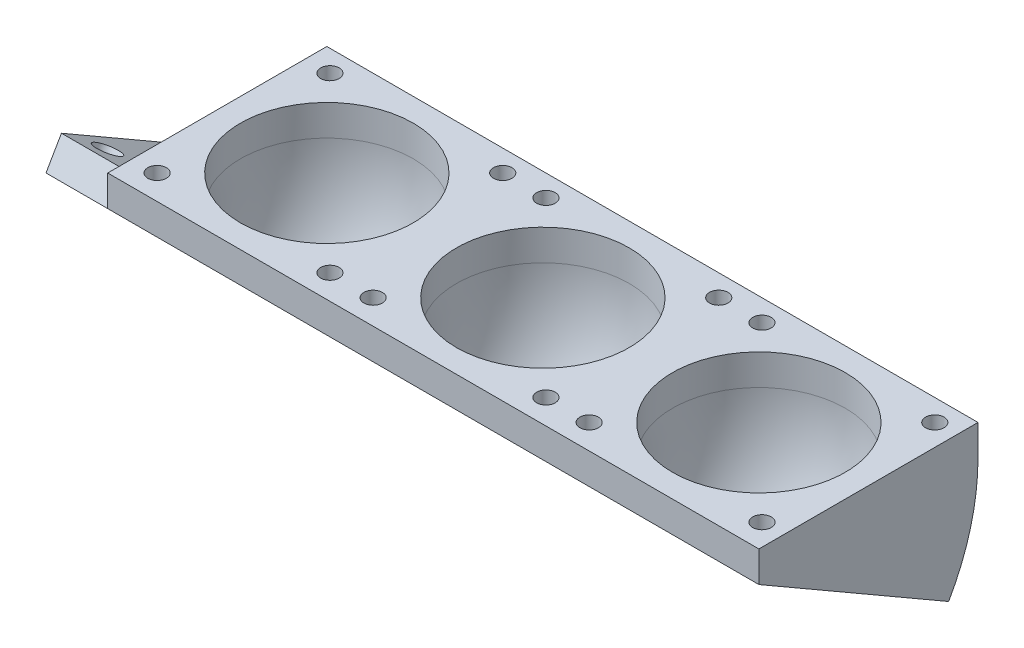
ISO-10303-21;
HEADER;
FILE_DESCRIPTION(('STEP AP214'),'2;1');
FILE_NAME('part.step','',(''),(''),'','','');
FILE_SCHEMA(('AUTOMOTIVE_DESIGN { 1 0 10303 214 1 1 1 1 }'));
ENDSEC;
DATA;
#1=APPLICATION_CONTEXT('core data for automotive mechanical design processes');
#2=APPLICATION_PROTOCOL_DEFINITION('international standard','automotive_design',2000,#1);
#3=PRODUCT_CONTEXT('',#1,'mechanical');
#4=PRODUCT('Part','Part','',(#3));
#5=PRODUCT_RELATED_PRODUCT_CATEGORY('part','',(#4));
#6=PRODUCT_DEFINITION_FORMATION('','',#4);
#7=PRODUCT_DEFINITION_CONTEXT('part definition',#1,'design');
#8=PRODUCT_DEFINITION('design','',#6,#7);
#9=PRODUCT_DEFINITION_SHAPE('','',#8);
#10=(LENGTH_UNIT() NAMED_UNIT(*) SI_UNIT(.MILLI.,.METRE.));
#11=(NAMED_UNIT(*) PLANE_ANGLE_UNIT() SI_UNIT($,.RADIAN.));
#12=(NAMED_UNIT(*) SI_UNIT($,.STERADIAN.) SOLID_ANGLE_UNIT());
#13=UNCERTAINTY_MEASURE_WITH_UNIT(LENGTH_MEASURE(1.E-05),#10,'distance_accuracy_value','');
#14=(GEOMETRIC_REPRESENTATION_CONTEXT(3) GLOBAL_UNCERTAINTY_ASSIGNED_CONTEXT((#13)) GLOBAL_UNIT_ASSIGNED_CONTEXT((#10,
#11,#12)) REPRESENTATION_CONTEXT('',''));
#15=CARTESIAN_POINT('',(0.,0.,0.));
#16=DIRECTION('',(0.,0.,1.));
#17=DIRECTION('',(1.,0.,0.));
#18=AXIS2_PLACEMENT_3D('',#15,#16,#17);
#19=CARTESIAN_POINT('',(0.,10.,0.));
#20=DIRECTION('',(0.,1.,0.));
#21=DIRECTION('',(0.,0.,1.));
#22=AXIS2_PLACEMENT_3D('',#19,#20,#21);
#23=PLANE('',#22);
#24=DIRECTION('',(-1.,0.,0.));
#25=VECTOR('',#24,1.);
#26=CARTESIAN_POINT('',(-51.4922279792746,10.,-44.0544041450777));
#27=LINE('',#26,#25);
#28=CARTESIAN_POINT('',(159.507772020725,10.,-44.0544041450777));
#29=VERTEX_POINT('',#28);
#30=CARTESIAN_POINT('',(-51.4922279792746,10.,-44.0544041450777));
#31=VERTEX_POINT('',#30);
#32=EDGE_CURVE('E51',#29,#31,#27,.T.);
#33=ORIENTED_EDGE('',*,*,#32,.T.);
#34=DIRECTION('',(0.,0.,1.));
#35=VECTOR('',#34,1.);
#36=CARTESIAN_POINT('',(-51.4922279792746,10.,-44.0544041450777));
#37=LINE('',#36,#35);
#38=CARTESIAN_POINT('',(-51.4922279792746,10.,26.9455958549222));
#39=VERTEX_POINT('',#38);
#40=EDGE_CURVE('E171',#31,#39,#37,.T.);
#41=ORIENTED_EDGE('',*,*,#40,.T.);
#42=DIRECTION('',(1.,0.,0.));
#43=VECTOR('',#42,1.);
#44=CARTESIAN_POINT('',(-51.4922279792746,10.,26.9455958549222));
#45=LINE('',#44,#43);
#46=CARTESIAN_POINT('',(159.507772020725,10.,26.9455958549222));
#47=VERTEX_POINT('',#46);
#48=EDGE_CURVE('E173',#39,#47,#45,.T.);
#49=ORIENTED_EDGE('',*,*,#48,.T.);
#50=DIRECTION('',(0.,0.,-1.));
#51=VECTOR('',#50,1.);
#52=CARTESIAN_POINT('',(159.507772020725,10.,-44.0544041450777));
#53=LINE('',#52,#51);
#54=EDGE_CURVE('E185',#47,#29,#53,.T.);
#55=ORIENTED_EDGE('',*,*,#54,.T.);
#56=EDGE_LOOP('',(#33,#41,#49,#55));
#57=FACE_BOUND('',#56,.T.);
#58=CARTESIAN_POINT('',(54.0077720207254,10.,-8.55440414507775));
#59=DIRECTION('',(0.,1.,0.));
#60=DIRECTION('',(0.,0.,1.));
#61=AXIS2_PLACEMENT_3D('',#58,#59,#60);
#62=CIRCLE('',#61,28.);
#63=CARTESIAN_POINT('',(54.0077720207254,10.,19.4455958549222));
#64=VERTEX_POINT('',#63);
#65=EDGE_CURVE('E205',#64,#64,#62,.T.);
#66=ORIENTED_EDGE('',*,*,#65,.F.);
#67=EDGE_LOOP('',(#66));
#68=FACE_BOUND('',#67,.T.);
#69=CARTESIAN_POINT('',(82.5077720207254,10.,18.9455958549223));
#70=DIRECTION('',(0.,1.,0.));
#71=DIRECTION('',(0.,0.,1.));
#72=AXIS2_PLACEMENT_3D('',#69,#70,#71);
#73=CIRCLE('',#72,3.);
#74=CARTESIAN_POINT('',(82.5077720207254,10.,21.9455958549223));
#75=VERTEX_POINT('',#74);
#76=EDGE_CURVE('E217',#75,#75,#73,.T.);
#77=ORIENTED_EDGE('',*,*,#76,.F.);
#78=EDGE_LOOP('',(#77));
#79=FACE_BOUND('',#78,.T.);
#80=CARTESIAN_POINT('',(26.5077720207254,10.,-37.0544041450777));
#81=DIRECTION('',(0.,1.,0.));
#82=DIRECTION('',(0.,0.,1.));
#83=AXIS2_PLACEMENT_3D('',#80,#81,#82);
#84=CIRCLE('',#83,3.);
#85=CARTESIAN_POINT('',(26.5077720207254,10.,-34.0544041450777));
#86=VERTEX_POINT('',#85);
#87=EDGE_CURVE('E229',#86,#86,#84,.T.);
#88=ORIENTED_EDGE('',*,*,#87,.F.);
#89=EDGE_LOOP('',(#88));
#90=FACE_BOUND('',#89,.T.);
#91=CARTESIAN_POINT('',(82.5077720207254,10.,-37.0544041450777));
#92=DIRECTION('',(0.,1.,0.));
#93=DIRECTION('',(0.,0.,1.));
#94=AXIS2_PLACEMENT_3D('',#91,#92,#93);
#95=CIRCLE('',#94,3.);
#96=CARTESIAN_POINT('',(82.5077720207254,10.,-34.0544041450777));
#97=VERTEX_POINT('',#96);
#98=EDGE_CURVE('E223',#97,#97,#95,.T.);
#99=ORIENTED_EDGE('',*,*,#98,.F.);
#100=EDGE_LOOP('',(#99));
#101=FACE_BOUND('',#100,.T.);
#102=CARTESIAN_POINT('',(26.5077720207254,10.,18.9455958549223));
#103=DIRECTION('',(0.,1.,0.));
#104=DIRECTION('',(0.,0.,1.));
#105=AXIS2_PLACEMENT_3D('',#102,#103,#104);
#106=CIRCLE('',#105,3.);
#107=CARTESIAN_POINT('',(26.5077720207254,10.,21.9455958549223));
#108=VERTEX_POINT('',#107);
#109=EDGE_CURVE('E211',#108,#108,#106,.T.);
#110=ORIENTED_EDGE('',*,*,#109,.F.);
#111=EDGE_LOOP('',(#110));
#112=FACE_BOUND('',#111,.T.);
#113=CARTESIAN_POINT('',(96.5077720207254,10.,18.9455958549223));
#114=DIRECTION('',(0.,1.,0.));
#115=DIRECTION('',(0.,0.,1.));
#116=AXIS2_PLACEMENT_3D('',#113,#114,#115);
#117=CIRCLE('',#116,3.);
#118=CARTESIAN_POINT('',(96.5077720207254,10.,21.9455958549223));
#119=VERTEX_POINT('',#118);
#120=EDGE_CURVE('E263',#119,#119,#117,.T.);
#121=ORIENTED_EDGE('',*,*,#120,.F.);
#122=EDGE_LOOP('',(#121));
#123=FACE_BOUND('',#122,.T.);
#124=CARTESIAN_POINT('',(152.507772020725,10.,-37.0544041450777));
#125=DIRECTION('',(0.,1.,0.));
#126=DIRECTION('',(0.,0.,1.));
#127=AXIS2_PLACEMENT_3D('',#124,#125,#126);
#128=CIRCLE('',#127,3.);
#129=CARTESIAN_POINT('',(152.507772020725,10.,-34.0544041450777));
#130=VERTEX_POINT('',#129);
#131=EDGE_CURVE('E275',#130,#130,#128,.T.);
#132=ORIENTED_EDGE('',*,*,#131,.F.);
#133=EDGE_LOOP('',(#132));
#134=FACE_BOUND('',#133,.T.);
#135=CARTESIAN_POINT('',(96.5077720207254,10.,-37.0544041450777));
#136=DIRECTION('',(0.,1.,0.));
#137=DIRECTION('',(0.,0.,1.));
#138=AXIS2_PLACEMENT_3D('',#135,#136,#137);
#139=CIRCLE('',#138,3.);
#140=CARTESIAN_POINT('',(96.5077720207254,10.,-34.0544041450777));
#141=VERTEX_POINT('',#140);
#142=EDGE_CURVE('E197',#141,#141,#139,.T.);
#143=ORIENTED_EDGE('',*,*,#142,.F.);
#144=EDGE_LOOP('',(#143));
#145=FACE_BOUND('',#144,.T.);
#146=CARTESIAN_POINT('',(152.507772020725,10.,18.9455958549223));
#147=DIRECTION('',(0.,1.,0.));
#148=DIRECTION('',(0.,0.,1.));
#149=AXIS2_PLACEMENT_3D('',#146,#147,#148);
#150=CIRCLE('',#149,3.);
#151=CARTESIAN_POINT('',(152.507772020725,10.,21.9455958549223));
#152=VERTEX_POINT('',#151);
#153=EDGE_CURVE('E269',#152,#152,#150,.T.);
#154=ORIENTED_EDGE('',*,*,#153,.F.);
#155=EDGE_LOOP('',(#154));
#156=FACE_BOUND('',#155,.T.);
#157=CARTESIAN_POINT('',(124.007772020725,10.,-8.55440414507775));
#158=DIRECTION('',(0.,1.,0.));
#159=DIRECTION('',(0.,0.,1.));
#160=AXIS2_PLACEMENT_3D('',#157,#158,#159);
#161=CIRCLE('',#160,28.);
#162=CARTESIAN_POINT('',(124.007772020725,10.,19.4455958549222));
#163=VERTEX_POINT('',#162);
#164=EDGE_CURVE('E257',#163,#163,#161,.T.);
#165=ORIENTED_EDGE('',*,*,#164,.F.);
#166=EDGE_LOOP('',(#165));
#167=FACE_BOUND('',#166,.T.);
#168=CARTESIAN_POINT('',(-43.4922279792746,10.,18.9455958549223));
#169=DIRECTION('',(0.,1.,0.));
#170=DIRECTION('',(0.,0.,1.));
#171=AXIS2_PLACEMENT_3D('',#168,#169,#170);
#172=CIRCLE('',#171,3.);
#173=CARTESIAN_POINT('',(-43.4922279792746,10.,21.9455958549223));
#174=VERTEX_POINT('',#173);
#175=EDGE_CURVE('E147',#174,#174,#172,.T.);
#176=ORIENTED_EDGE('',*,*,#175,.F.);
#177=EDGE_LOOP('',(#176));
#178=FACE_BOUND('',#177,.T.);
#179=CARTESIAN_POINT('',(12.5077720207254,10.,-37.0544041450777));
#180=DIRECTION('',(0.,1.,0.));
#181=DIRECTION('',(0.,0.,1.));
#182=AXIS2_PLACEMENT_3D('',#179,#180,#181);
#183=CIRCLE('',#182,3.);
#184=CARTESIAN_POINT('',(12.5077720207254,10.,-34.0544041450777));
#185=VERTEX_POINT('',#184);
#186=EDGE_CURVE('E159',#185,#185,#183,.T.);
#187=ORIENTED_EDGE('',*,*,#186,.F.);
#188=EDGE_LOOP('',(#187));
#189=FACE_BOUND('',#188,.T.);
#190=CARTESIAN_POINT('',(-43.4922279792746,10.,-37.0544041450777));
#191=DIRECTION('',(0.,1.,0.));
#192=DIRECTION('',(0.,0.,1.));
#193=AXIS2_PLACEMENT_3D('',#190,#191,#192);
#194=CIRCLE('',#193,3.);
#195=CARTESIAN_POINT('',(-43.4922279792746,10.,-34.0544041450777));
#196=VERTEX_POINT('',#195);
#197=EDGE_CURVE('E165',#196,#196,#194,.T.);
#198=ORIENTED_EDGE('',*,*,#197,.F.);
#199=EDGE_LOOP('',(#198));
#200=FACE_BOUND('',#199,.T.);
#201=CARTESIAN_POINT('',(12.5077720207254,10.,18.9455958549223));
#202=DIRECTION('',(0.,1.,0.));
#203=DIRECTION('',(0.,0.,1.));
#204=AXIS2_PLACEMENT_3D('',#201,#202,#203);
#205=CIRCLE('',#204,3.);
#206=CARTESIAN_POINT('',(12.5077720207254,10.,21.9455958549223));
#207=VERTEX_POINT('',#206);
#208=EDGE_CURVE('E153',#207,#207,#205,.T.);
#209=ORIENTED_EDGE('',*,*,#208,.F.);
#210=EDGE_LOOP('',(#209));
#211=FACE_BOUND('',#210,.T.);
#212=CARTESIAN_POINT('',(-15.9922279792746,10.,-8.55440414507775));
#213=DIRECTION('',(0.,1.,0.));
#214=DIRECTION('',(0.,0.,1.));
#215=AXIS2_PLACEMENT_3D('',#212,#213,#214);
#216=CIRCLE('',#215,28.);
#217=CARTESIAN_POINT('',(-15.9922279792746,10.,19.4455958549222));
#218=VERTEX_POINT('',#217);
#219=EDGE_CURVE('E139',#218,#218,#216,.T.);
#220=ORIENTED_EDGE('',*,*,#219,.F.);
#221=EDGE_LOOP('',(#220));
#222=FACE_BOUND('',#221,.T.);
#223=ADVANCED_FACE('F33',(#57,#68,#79,#90,#101,#112,#123,#134,#145,#156,#167,#178,#189,#200,
#211,#222),#23,.T.);
#224=CARTESIAN_POINT('',(-51.4922279792746,10.,-44.0544041450777));
#225=DIRECTION('',(1.,0.,0.));
#226=DIRECTION('',(0.,0.,-1.));
#227=AXIS2_PLACEMENT_3D('',#224,#225,#226);
#228=PLANE('',#227);
#229=CARTESIAN_POINT('',(-51.4922279792746,0.,26.9455958549222));
#230=DIRECTION('',(1.,0.,0.));
#231=DIRECTION('',(0.,0.,-1.));
#232=AXIS2_PLACEMENT_3D('',#229,#230,#231);
#233=CIRCLE('',#232,71.);
#234=CARTESIAN_POINT('',(-51.4922279792746,-26.4858695037356,-38.9292758081868));
#235=VERTEX_POINT('',#234);
#236=CARTESIAN_POINT('',(-51.4922279792746,0.,-44.0544041450777));
#237=VERTEX_POINT('',#236);
#238=EDGE_CURVE('E123',#235,#237,#233,.T.);
#239=ORIENTED_EDGE('',*,*,#238,.F.);
#240=DIRECTION('',(0.,0.500000000000001,0.866025403784438));
#241=VECTOR('',#240,1.);
#242=CARTESIAN_POINT('',(-51.4922279792746,8.66025403784438,21.9455958549222));
#243=LINE('',#242,#241);
#244=CARTESIAN_POINT('',(-51.4922279792746,8.66025403784438,21.9455958549222));
#245=VERTEX_POINT('',#244);
#246=EDGE_CURVE('E11',#235,#245,#243,.T.);
#247=ORIENTED_EDGE('',*,*,#246,.T.);
#248=DIRECTION('',(0.,-0.866025403784438,0.500000000000001));
#249=VECTOR('',#248,1.);
#250=CARTESIAN_POINT('',(-51.4922279792746,8.66025403784438,21.9455958549222));
#251=LINE('',#250,#249);
#252=CARTESIAN_POINT('',(-51.4922279792746,0.,26.9455958549222));
#253=VERTEX_POINT('',#252);
#254=EDGE_CURVE('E99',#245,#253,#251,.T.);
#255=ORIENTED_EDGE('',*,*,#254,.T.);
#256=DIRECTION('',(0.,-1.,0.));
#257=VECTOR('',#256,1.);
#258=CARTESIAN_POINT('',(-51.4922279792746,10.,26.9455958549222));
#259=LINE('',#258,#257);
#260=EDGE_CURVE('E37',#39,#253,#259,.T.);
#261=ORIENTED_EDGE('',*,*,#260,.F.);
#262=ORIENTED_EDGE('',*,*,#40,.F.);
#263=DIRECTION('',(0.,-1.,0.));
#264=VECTOR('',#263,1.);
#265=CARTESIAN_POINT('',(-51.4922279792746,10.,-44.0544041450777));
#266=LINE('',#265,#264);
#267=EDGE_CURVE('E126',#31,#237,#266,.T.);
#268=ORIENTED_EDGE('',*,*,#267,.T.);
#269=EDGE_LOOP('',(#239,#247,#255,#261,#262,#268));
#270=FACE_BOUND('',#269,.T.);
#271=ADVANCED_FACE('F35',(#270),#228,.F.);
#272=CARTESIAN_POINT('',(-51.4922279792746,10.,26.9455958549222));
#273=DIRECTION('',(0.,0.,-1.));
#274=DIRECTION('',(-1.,0.,0.));
#275=AXIS2_PLACEMENT_3D('',#272,#273,#274);
#276=PLANE('',#275);
#277=DIRECTION('',(0.,-1.,0.));
#278=VECTOR('',#277,1.);
#279=CARTESIAN_POINT('',(159.507772020725,10.,26.9455958549222));
#280=LINE('',#279,#278);
#281=CARTESIAN_POINT('',(159.507772020725,0.,26.9455958549222));
#282=VERTEX_POINT('',#281);
#283=EDGE_CURVE('E188',#47,#282,#280,.T.);
#284=ORIENTED_EDGE('',*,*,#283,.F.);
#285=ORIENTED_EDGE('',*,*,#48,.F.);
#286=ORIENTED_EDGE('',*,*,#260,.T.);
#287=DIRECTION('',(1.,0.,0.));
#288=VECTOR('',#287,1.);
#289=CARTESIAN_POINT('',(-51.4922279792746,0.,26.9455958549222));
#290=LINE('',#289,#288);
#291=EDGE_CURVE('E168',#253,#282,#290,.T.);
#292=ORIENTED_EDGE('',*,*,#291,.T.);
#293=EDGE_LOOP('',(#284,#285,#286,#292));
#294=FACE_BOUND('',#293,.T.);
#295=ADVANCED_FACE('F181',(#294),#276,.F.);
#296=CARTESIAN_POINT('',(-51.4922279792746,10.,-44.0544041450777));
#297=DIRECTION('',(0.,0.,1.));
#298=DIRECTION('',(1.,0.,0.));
#299=AXIS2_PLACEMENT_3D('',#296,#297,#298);
#300=PLANE('',#299);
#301=DIRECTION('',(-1.,0.,0.));
#302=VECTOR('',#301,1.);
#303=CARTESIAN_POINT('',(-51.4922279792746,0.,-44.0544041450777));
#304=LINE('',#303,#302);
#305=CARTESIAN_POINT('',(159.507772020725,0.,-44.0544041450777));
#306=VERTEX_POINT('',#305);
#307=EDGE_CURVE('E174',#306,#237,#304,.T.);
#308=ORIENTED_EDGE('',*,*,#307,.T.);
#309=ORIENTED_EDGE('',*,*,#267,.F.);
#310=ORIENTED_EDGE('',*,*,#32,.F.);
#311=DIRECTION('',(0.,-1.,0.));
#312=VECTOR('',#311,1.);
#313=CARTESIAN_POINT('',(159.507772020725,10.,-44.0544041450777));
#314=LINE('',#313,#312);
#315=EDGE_CURVE('E192',#29,#306,#314,.T.);
#316=ORIENTED_EDGE('',*,*,#315,.T.);
#317=EDGE_LOOP('',(#308,#309,#310,#316));
#318=FACE_BOUND('',#317,.T.);
#319=ADVANCED_FACE('F307',(#318),#300,.F.);
#320=CARTESIAN_POINT('',(-43.4922279792746,10.,-37.0544041450777));
#321=DIRECTION('',(0.,-1.,0.));
#322=DIRECTION('',(0.,0.,-1.));
#323=AXIS2_PLACEMENT_3D('',#320,#321,#322);
#324=CYLINDRICAL_SURFACE('',#323,3.);
#325=ORIENTED_EDGE('',*,*,#197,.T.);
#326=EDGE_LOOP('',(#325));
#327=FACE_BOUND('',#326,.T.);
#328=CARTESIAN_POINT('',(-43.4922279792746,0.,-37.0544041450777));
#329=DIRECTION('',(0.,1.,0.));
#330=DIRECTION('',(0.,0.,1.));
#331=AXIS2_PLACEMENT_3D('',#328,#329,#330);
#332=CIRCLE('',#331,3.);
#333=CARTESIAN_POINT('',(-43.4922279792746,0.,-34.0544041450777));
#334=VERTEX_POINT('',#333);
#335=EDGE_CURVE('E162',#334,#334,#332,.T.);
#336=ORIENTED_EDGE('',*,*,#335,.F.);
#337=EDGE_LOOP('',(#336));
#338=FACE_BOUND('',#337,.T.);
#339=ADVANCED_FACE('F305',(#327,#338),#324,.F.);
#340=CARTESIAN_POINT('',(12.5077720207254,10.,-37.0544041450777));
#341=DIRECTION('',(0.,-1.,0.));
#342=DIRECTION('',(0.,0.,-1.));
#343=AXIS2_PLACEMENT_3D('',#340,#341,#342);
#344=CYLINDRICAL_SURFACE('',#343,3.);
#345=ORIENTED_EDGE('',*,*,#186,.T.);
#346=EDGE_LOOP('',(#345));
#347=FACE_BOUND('',#346,.T.);
#348=CARTESIAN_POINT('',(12.5077720207254,0.,-37.0544041450777));
#349=DIRECTION('',(0.,1.,0.));
#350=DIRECTION('',(0.,0.,1.));
#351=AXIS2_PLACEMENT_3D('',#348,#349,#350);
#352=CIRCLE('',#351,3.);
#353=CARTESIAN_POINT('',(12.5077720207254,0.,-34.0544041450777));
#354=VERTEX_POINT('',#353);
#355=EDGE_CURVE('E156',#354,#354,#352,.T.);
#356=ORIENTED_EDGE('',*,*,#355,.F.);
#357=EDGE_LOOP('',(#356));
#358=FACE_BOUND('',#357,.T.);
#359=ADVANCED_FACE('F327',(#347,#358),#344,.F.);
#360=CARTESIAN_POINT('',(12.5077720207254,10.,18.9455958549223));
#361=DIRECTION('',(0.,-1.,0.));
#362=DIRECTION('',(0.,0.,-1.));
#363=AXIS2_PLACEMENT_3D('',#360,#361,#362);
#364=CYLINDRICAL_SURFACE('',#363,3.);
#365=ORIENTED_EDGE('',*,*,#208,.T.);
#366=EDGE_LOOP('',(#365));
#367=FACE_BOUND('',#366,.T.);
#368=CARTESIAN_POINT('',(12.5077720207254,0.,18.9455958549223));
#369=DIRECTION('',(0.,1.,0.));
#370=DIRECTION('',(0.,0.,1.));
#371=AXIS2_PLACEMENT_3D('',#368,#369,#370);
#372=CIRCLE('',#371,3.);
#373=CARTESIAN_POINT('',(12.5077720207254,0.,21.9455958549223));
#374=VERTEX_POINT('',#373);
#375=EDGE_CURVE('E150',#374,#374,#372,.T.);
#376=ORIENTED_EDGE('',*,*,#375,.F.);
#377=EDGE_LOOP('',(#376));
#378=FACE_BOUND('',#377,.T.);
#379=ADVANCED_FACE('F334',(#367,#378),#364,.F.);
#380=CARTESIAN_POINT('',(-43.4922279792746,10.,18.9455958549223));
#381=DIRECTION('',(0.,-1.,0.));
#382=DIRECTION('',(0.,0.,-1.));
#383=AXIS2_PLACEMENT_3D('',#380,#381,#382);
#384=CYLINDRICAL_SURFACE('',#383,3.);
#385=ORIENTED_EDGE('',*,*,#175,.T.);
#386=EDGE_LOOP('',(#385));
#387=FACE_BOUND('',#386,.T.);
#388=CARTESIAN_POINT('',(-43.4922279792746,0.,18.9455958549223));
#389=DIRECTION('',(0.,1.,0.));
#390=DIRECTION('',(0.,0.,1.));
#391=AXIS2_PLACEMENT_3D('',#388,#389,#390);
#392=CIRCLE('',#391,3.);
#393=CARTESIAN_POINT('',(-43.4922279792746,0.,21.9455958549223));
#394=VERTEX_POINT('',#393);
#395=EDGE_CURVE('E145',#394,#394,#392,.T.);
#396=ORIENTED_EDGE('',*,*,#395,.F.);
#397=EDGE_LOOP('',(#396));
#398=FACE_BOUND('',#397,.T.);
#399=ADVANCED_FACE('F341',(#387,#398),#384,.F.);
#400=CARTESIAN_POINT('',(-15.9922279792746,10.,-8.55440414507775));
#401=DIRECTION('',(0.,-1.,0.));
#402=DIRECTION('',(0.,0.,-1.));
#403=AXIS2_PLACEMENT_3D('',#400,#401,#402);
#404=CYLINDRICAL_SURFACE('',#403,28.);
#405=ORIENTED_EDGE('',*,*,#219,.T.);
#406=EDGE_LOOP('',(#405));
#407=FACE_BOUND('',#406,.T.);
#408=CARTESIAN_POINT('',(-15.9922279792746,0.,-8.55440414507775));
#409=DIRECTION('',(0.,1.,0.));
#410=DIRECTION('',(0.,0.,1.));
#411=AXIS2_PLACEMENT_3D('',#408,#409,#410);
#412=CIRCLE('',#411,28.);
#413=CARTESIAN_POINT('',(-15.9922279792746,0.,-36.5544041450778));
#414=VERTEX_POINT('',#413);
#415=EDGE_CURVE('E137',#414,#414,#412,.T.);
#416=ORIENTED_EDGE('',*,*,#415,.F.);
#417=EDGE_LOOP('',(#416));
#418=FACE_BOUND('',#417,.T.);
#419=ADVANCED_FACE('F349',(#407,#418),#404,.F.);
#420=CARTESIAN_POINT('',(0.,-13.4727979274612,3.61002532445093));
#421=DIRECTION('',(0.,-0.866025403784438,0.500000000000001));
#422=DIRECTION('',(0.,-0.500000000000001,-0.866025403784438));
#423=AXIS2_PLACEMENT_3D('',#420,#421,#422);
#424=PLANE('',#423);
#425=CARTESIAN_POINT('',(-63.4922279792746,-31.5000000000001,-27.6140045834974));
#426=DIRECTION('',(0.,-0.866025403784438,0.500000000000001));
#427=DIRECTION('',(0.,-0.500000000000001,-0.866025403784438));
#428=AXIS2_PLACEMENT_3D('',#425,#426,#427);
#429=CIRCLE('',#428,4.00000000000001);
#430=CARTESIAN_POINT('',(-63.4922279792746,-33.5000000000001,-31.0781061986351));
#431=VERTEX_POINT('',#430);
#432=EDGE_CURVE('E730',#431,#431,#429,.T.);
#433=ORIENTED_EDGE('',*,*,#432,.F.);
#434=EDGE_LOOP('',(#433));
#435=FACE_BOUND('',#434,.T.);
#436=CARTESIAN_POINT('',(-63.4922279792746,-4.00000000000001,20.0173926246467));
#437=DIRECTION('',(0.,-0.866025403784438,0.500000000000001));
#438=DIRECTION('',(0.,-0.500000000000001,-0.866025403784438));
#439=AXIS2_PLACEMENT_3D('',#436,#437,#438);
#440=CIRCLE('',#439,4.00000000000001);
#441=CARTESIAN_POINT('',(-63.4922279792746,-6.00000000000001,16.553291009509));
#442=VERTEX_POINT('',#441);
#443=EDGE_CURVE('E732',#442,#442,#440,.T.);
#444=ORIENTED_EDGE('',*,*,#443,.F.);
#445=EDGE_LOOP('',(#444));
#446=FACE_BOUND('',#445,.T.);
#447=DIRECTION('',(0.,0.500000000000001,0.866025403784438));
#448=VECTOR('',#447,1.);
#449=CARTESIAN_POINT('',(159.507772020725,-35.5000000000001,-34.5422078137728));
#450=LINE('',#449,#448);
#451=CARTESIAN_POINT('',(159.507772020725,-35.5000000000001,-34.5422078137728));
#452=VERTEX_POINT('',#451);
#453=EDGE_CURVE('E241',#452,#282,#450,.T.);
#454=ORIENTED_EDGE('',*,*,#453,.T.);
#455=ORIENTED_EDGE('',*,*,#291,.F.);
#456=DIRECTION('',(-1.,0.,0.));
#457=VECTOR('',#456,1.);
#458=CARTESIAN_POINT('',(-51.4922279792746,0.,26.9455958549223));
#459=LINE('',#458,#457);
#460=CARTESIAN_POINT('',(-71.4922279792746,0.,26.9455958549222));
#461=VERTEX_POINT('',#460);
#462=EDGE_CURVE('E104',#253,#461,#459,.T.);
#463=ORIENTED_EDGE('',*,*,#462,.T.);
#464=DIRECTION('',(0.,-0.500000000000001,-0.866025403784438));
#465=VECTOR('',#464,1.);
#466=CARTESIAN_POINT('',(-71.4922279792746,0.,26.9455958549222));
#467=LINE('',#466,#465);
#468=CARTESIAN_POINT('',(-71.4922279792746,-35.5000000000001,-34.5422078137729));
#469=VERTEX_POINT('',#468);
#470=EDGE_CURVE('E744',#461,#469,#467,.T.);
#471=ORIENTED_EDGE('',*,*,#470,.T.);
#472=DIRECTION('',(1.,0.,0.));
#473=VECTOR('',#472,1.);
#474=CARTESIAN_POINT('',(-51.4922279792746,-35.5000000000001,-34.5422078137729));
#475=LINE('',#474,#473);
#476=CARTESIAN_POINT('',(-51.4922279792746,-35.5000000000001,-34.5422078137729));
#477=VERTEX_POINT('',#476);
#478=EDGE_CURVE('E244',#469,#477,#475,.T.);
#479=ORIENTED_EDGE('',*,*,#478,.T.);
#480=DIRECTION('',(1.,0.,0.));
#481=VECTOR('',#480,1.);
#482=CARTESIAN_POINT('',(-51.4922279792746,-35.5000000000001,-34.5422078137728));
#483=LINE('',#482,#481);
#484=EDGE_CURVE('E130',#477,#452,#483,.T.);
#485=ORIENTED_EDGE('',*,*,#484,.T.);
#486=EDGE_LOOP('',(#454,#455,#463,#471,#479,#485));
#487=FACE_BOUND('',#486,.T.);
#488=CARTESIAN_POINT('',(124.007772020725,-17.75,-3.7983059794253));
#489=DIRECTION('',(0.,-0.866025403784438,0.500000000000001));
#490=DIRECTION('',(0.,-0.500000000000001,-0.866025403784438));
#491=AXIS2_PLACEMENT_3D('',#488,#489,#490);
#492=CIRCLE('',#491,28.);
#493=CARTESIAN_POINT('',(124.007772020725,-31.7500000000001,-28.0470172853896));
#494=VERTEX_POINT('',#493);
#495=EDGE_CURVE('E248',#494,#494,#492,.T.);
#496=ORIENTED_EDGE('',*,*,#495,.F.);
#497=EDGE_LOOP('',(#496));
#498=FACE_BOUND('',#497,.T.);
#499=CARTESIAN_POINT('',(-15.9922279792746,-17.75,-3.7983059794253));
#500=DIRECTION('',(0.,-0.866025403784438,0.500000000000001));
#501=DIRECTION('',(0.,-0.500000000000001,-0.866025403784438));
#502=AXIS2_PLACEMENT_3D('',#499,#500,#501);
#503=CIRCLE('',#502,28.);
#504=CARTESIAN_POINT('',(-15.9922279792746,-31.7500000000001,-28.0470172853896));
#505=VERTEX_POINT('',#504);
#506=EDGE_CURVE('E232',#505,#505,#503,.T.);
#507=ORIENTED_EDGE('',*,*,#506,.F.);
#508=EDGE_LOOP('',(#507));
#509=FACE_BOUND('',#508,.T.);
#510=CARTESIAN_POINT('',(54.0077720207254,-17.75,-3.7983059794253));
#511=DIRECTION('',(0.,-0.866025403784438,0.500000000000001));
#512=DIRECTION('',(0.,-0.500000000000001,-0.866025403784438));
#513=AXIS2_PLACEMENT_3D('',#510,#511,#512);
#514=CIRCLE('',#513,28.);
#515=CARTESIAN_POINT('',(54.0077720207254,-31.7500000000001,-28.0470172853896));
#516=VERTEX_POINT('',#515);
#517=EDGE_CURVE('E246',#516,#516,#514,.T.);
#518=ORIENTED_EDGE('',*,*,#517,.F.);
#519=EDGE_LOOP('',(#518));
#520=FACE_BOUND('',#519,.T.);
#521=ADVANCED_FACE('F239',(#435,#446,#487,#498,#509,#520),#424,.T.);
#522=CARTESIAN_POINT('',(-15.9922279792746,0.,26.9455958549222));
#523=DIRECTION('',(1.,0.,0.));
#524=DIRECTION('',(0.,0.,-1.));
#525=AXIS2_PLACEMENT_3D('',#522,#523,#524);
#526=TOROIDAL_SURFACE('',#525,35.5,28.);
#527=CARTESIAN_POINT('',(-15.9922279792746,0.,26.9455958549222));
#528=DIRECTION('',(1.,0.,0.));
#529=DIRECTION('',(0.,0.,-1.));
#530=AXIS2_PLACEMENT_3D('',#527,#528,#529);
#531=CIRCLE('',#530,63.5);
#532=EDGE_CURVE('',#505,#414,#531,.T.);
#533=ORIENTED_EDGE('',*,*,#506,.T.);
#534=ORIENTED_EDGE('',*,*,#415,.T.);
#535=ORIENTED_EDGE('',*,*,#532,.T.);
#536=ORIENTED_EDGE('',*,*,#532,.F.);
#537=EDGE_LOOP('',(#533,#535,#534,#536));
#538=FACE_BOUND('',#537,.T.);
#539=ADVANCED_FACE('F365',(#538),#526,.F.);
#540=CARTESIAN_POINT('',(19.5077720207254,0.,26.9455958549222));
#541=DIRECTION('',(1.,0.,0.));
#542=DIRECTION('',(0.,0.,-1.));
#543=AXIS2_PLACEMENT_3D('',#540,#541,#542);
#544=CYLINDRICAL_SURFACE('',#543,71.);
#545=CARTESIAN_POINT('',(159.507772020725,0.,26.9455958549222));
#546=DIRECTION('',(1.,0.,0.));
#547=DIRECTION('',(0.,0.,-1.));
#548=AXIS2_PLACEMENT_3D('',#545,#546,#547);
#549=CIRCLE('',#548,71.);
#550=EDGE_CURVE('E245',#452,#306,#549,.T.);
#551=ORIENTED_EDGE('',*,*,#550,.F.);
#552=ORIENTED_EDGE('',*,*,#484,.F.);
#553=EDGE_CURVE('E129',#477,#235,#233,.T.);
#554=ORIENTED_EDGE('',*,*,#553,.T.);
#555=ORIENTED_EDGE('',*,*,#238,.T.);
#556=ORIENTED_EDGE('',*,*,#307,.F.);
#557=EDGE_LOOP('',(#551,#552,#554,#555,#556));
#558=FACE_BOUND('',#557,.T.);
#559=ADVANCED_FACE('F134',(#558),#544,.T.);
#560=CARTESIAN_POINT('',(0.,0.,0.));
#561=DIRECTION('',(0.,-1.,0.));
#562=DIRECTION('',(0.,0.,-1.));
#563=AXIS2_PLACEMENT_3D('',#560,#561,#562);
#564=PLANE('',#563);
#565=ORIENTED_EDGE('',*,*,#395,.T.);
#566=EDGE_LOOP('',(#565));
#567=FACE_BOUND('',#566,.T.);
#568=ADVANCED_FACE('F380',(#567),#564,.F.);
#569=ORIENTED_EDGE('',*,*,#375,.T.);
#570=EDGE_LOOP('',(#569));
#571=FACE_BOUND('',#570,.T.);
#572=ADVANCED_FACE('F387',(#571),#564,.F.);
#573=ORIENTED_EDGE('',*,*,#355,.T.);
#574=EDGE_LOOP('',(#573));
#575=FACE_BOUND('',#574,.T.);
#576=ADVANCED_FACE('F396',(#575),#564,.F.);
#577=ORIENTED_EDGE('',*,*,#335,.T.);
#578=EDGE_LOOP('',(#577));
#579=FACE_BOUND('',#578,.T.);
#580=ADVANCED_FACE('F390',(#579),#564,.F.);
#581=CARTESIAN_POINT('',(26.5077720207254,10.,-37.0544041450777));
#582=DIRECTION('',(0.,-1.,0.));
#583=DIRECTION('',(0.,0.,-1.));
#584=AXIS2_PLACEMENT_3D('',#581,#582,#583);
#585=CYLINDRICAL_SURFACE('',#584,3.);
#586=ORIENTED_EDGE('',*,*,#87,.T.);
#587=EDGE_LOOP('',(#586));
#588=FACE_BOUND('',#587,.T.);
#589=CARTESIAN_POINT('',(26.5077720207254,0.,-37.0544041450777));
#590=DIRECTION('',(0.,1.,0.));
#591=DIRECTION('',(0.,0.,1.));
#592=AXIS2_PLACEMENT_3D('',#589,#590,#591);
#593=CIRCLE('',#592,3.);
#594=CARTESIAN_POINT('',(26.5077720207254,0.,-34.0544041450777));
#595=VERTEX_POINT('',#594);
#596=EDGE_CURVE('E226',#595,#595,#593,.T.);
#597=ORIENTED_EDGE('',*,*,#596,.F.);
#598=EDGE_LOOP('',(#597));
#599=FACE_BOUND('',#598,.T.);
#600=ADVANCED_FACE('F409',(#588,#599),#585,.F.);
#601=CARTESIAN_POINT('',(82.5077720207254,10.,-37.0544041450777));
#602=DIRECTION('',(0.,-1.,0.));
#603=DIRECTION('',(0.,0.,-1.));
#604=AXIS2_PLACEMENT_3D('',#601,#602,#603);
#605=CYLINDRICAL_SURFACE('',#604,3.);
#606=ORIENTED_EDGE('',*,*,#98,.T.);
#607=EDGE_LOOP('',(#606));
#608=FACE_BOUND('',#607,.T.);
#609=CARTESIAN_POINT('',(82.5077720207254,0.,-37.0544041450777));
#610=DIRECTION('',(0.,1.,0.));
#611=DIRECTION('',(0.,0.,1.));
#612=AXIS2_PLACEMENT_3D('',#609,#610,#611);
#613=CIRCLE('',#612,3.);
#614=CARTESIAN_POINT('',(82.5077720207254,0.,-34.0544041450777));
#615=VERTEX_POINT('',#614);
#616=EDGE_CURVE('E220',#615,#615,#613,.T.);
#617=ORIENTED_EDGE('',*,*,#616,.F.);
#618=EDGE_LOOP('',(#617));
#619=FACE_BOUND('',#618,.T.);
#620=ADVANCED_FACE('F415',(#608,#619),#605,.F.);
#621=CARTESIAN_POINT('',(82.5077720207254,10.,18.9455958549223));
#622=DIRECTION('',(0.,-1.,0.));
#623=DIRECTION('',(0.,0.,-1.));
#624=AXIS2_PLACEMENT_3D('',#621,#622,#623);
#625=CYLINDRICAL_SURFACE('',#624,3.);
#626=ORIENTED_EDGE('',*,*,#76,.T.);
#627=EDGE_LOOP('',(#626));
#628=FACE_BOUND('',#627,.T.);
#629=CARTESIAN_POINT('',(82.5077720207254,0.,18.9455958549223));
#630=DIRECTION('',(0.,1.,0.));
#631=DIRECTION('',(0.,0.,1.));
#632=AXIS2_PLACEMENT_3D('',#629,#630,#631);
#633=CIRCLE('',#632,3.);
#634=CARTESIAN_POINT('',(82.5077720207254,0.,21.9455958549223));
#635=VERTEX_POINT('',#634);
#636=EDGE_CURVE('E214',#635,#635,#633,.T.);
#637=ORIENTED_EDGE('',*,*,#636,.F.);
#638=EDGE_LOOP('',(#637));
#639=FACE_BOUND('',#638,.T.);
#640=ADVANCED_FACE('F423',(#628,#639),#625,.F.);
#641=CARTESIAN_POINT('',(26.5077720207254,10.,18.9455958549223));
#642=DIRECTION('',(0.,-1.,0.));
#643=DIRECTION('',(0.,0.,-1.));
#644=AXIS2_PLACEMENT_3D('',#641,#642,#643);
#645=CYLINDRICAL_SURFACE('',#644,3.);
#646=ORIENTED_EDGE('',*,*,#109,.T.);
#647=EDGE_LOOP('',(#646));
#648=FACE_BOUND('',#647,.T.);
#649=CARTESIAN_POINT('',(26.5077720207254,0.,18.9455958549223));
#650=DIRECTION('',(0.,1.,0.));
#651=DIRECTION('',(0.,0.,1.));
#652=AXIS2_PLACEMENT_3D('',#649,#650,#651);
#653=CIRCLE('',#652,3.);
#654=CARTESIAN_POINT('',(26.5077720207254,0.,21.9455958549223));
#655=VERTEX_POINT('',#654);
#656=EDGE_CURVE('E208',#655,#655,#653,.T.);
#657=ORIENTED_EDGE('',*,*,#656,.F.);
#658=EDGE_LOOP('',(#657));
#659=FACE_BOUND('',#658,.T.);
#660=ADVANCED_FACE('F431',(#648,#659),#645,.F.);
#661=CARTESIAN_POINT('',(54.0077720207254,10.,-8.55440414507775));
#662=DIRECTION('',(0.,-1.,0.));
#663=DIRECTION('',(0.,0.,-1.));
#664=AXIS2_PLACEMENT_3D('',#661,#662,#663);
#665=CYLINDRICAL_SURFACE('',#664,28.);
#666=ORIENTED_EDGE('',*,*,#65,.T.);
#667=EDGE_LOOP('',(#666));
#668=FACE_BOUND('',#667,.T.);
#669=CARTESIAN_POINT('',(54.0077720207254,0.,-8.55440414507775));
#670=DIRECTION('',(0.,1.,0.));
#671=DIRECTION('',(0.,0.,1.));
#672=AXIS2_PLACEMENT_3D('',#669,#670,#671);
#673=CIRCLE('',#672,28.);
#674=CARTESIAN_POINT('',(54.0077720207254,0.,-36.5544041450778));
#675=VERTEX_POINT('',#674);
#676=EDGE_CURVE('E191',#675,#675,#673,.T.);
#677=ORIENTED_EDGE('',*,*,#676,.F.);
#678=EDGE_LOOP('',(#677));
#679=FACE_BOUND('',#678,.T.);
#680=ADVANCED_FACE('F439',(#668,#679),#665,.F.);
#681=CARTESIAN_POINT('',(159.507772020725,10.,-44.0544041450777));
#682=DIRECTION('',(-1.,0.,0.));
#683=DIRECTION('',(0.,0.,1.));
#684=AXIS2_PLACEMENT_3D('',#681,#682,#683);
#685=PLANE('',#684);
#686=ORIENTED_EDGE('',*,*,#283,.T.);
#687=ORIENTED_EDGE('',*,*,#453,.F.);
#688=ORIENTED_EDGE('',*,*,#550,.T.);
#689=ORIENTED_EDGE('',*,*,#315,.F.);
#690=ORIENTED_EDGE('',*,*,#54,.F.);
#691=EDGE_LOOP('',(#686,#687,#688,#689,#690));
#692=FACE_BOUND('',#691,.T.);
#693=ADVANCED_FACE('F194',(#692),#685,.F.);
#694=CARTESIAN_POINT('',(96.5077720207254,10.,-37.0544041450777));
#695=DIRECTION('',(0.,-1.,0.));
#696=DIRECTION('',(0.,0.,-1.));
#697=AXIS2_PLACEMENT_3D('',#694,#695,#696);
#698=CYLINDRICAL_SURFACE('',#697,3.);
#699=ORIENTED_EDGE('',*,*,#142,.T.);
#700=EDGE_LOOP('',(#699));
#701=FACE_BOUND('',#700,.T.);
#702=CARTESIAN_POINT('',(96.5077720207254,0.,-37.0544041450777));
#703=DIRECTION('',(0.,1.,0.));
#704=DIRECTION('',(0.,0.,1.));
#705=AXIS2_PLACEMENT_3D('',#702,#703,#704);
#706=CIRCLE('',#705,3.);
#707=CARTESIAN_POINT('',(96.5077720207254,0.,-34.0544041450777));
#708=VERTEX_POINT('',#707);
#709=EDGE_CURVE('E201',#708,#708,#706,.T.);
#710=ORIENTED_EDGE('',*,*,#709,.F.);
#711=EDGE_LOOP('',(#710));
#712=FACE_BOUND('',#711,.T.);
#713=ADVANCED_FACE('F286',(#701,#712),#698,.F.);
#714=CARTESIAN_POINT('',(152.507772020725,10.,-37.0544041450777));
#715=DIRECTION('',(0.,-1.,0.));
#716=DIRECTION('',(0.,0.,-1.));
#717=AXIS2_PLACEMENT_3D('',#714,#715,#716);
#718=CYLINDRICAL_SURFACE('',#717,3.);
#719=ORIENTED_EDGE('',*,*,#131,.T.);
#720=EDGE_LOOP('',(#719));
#721=FACE_BOUND('',#720,.T.);
#722=CARTESIAN_POINT('',(152.507772020725,0.,-37.0544041450777));
#723=DIRECTION('',(0.,1.,0.));
#724=DIRECTION('',(0.,0.,1.));
#725=AXIS2_PLACEMENT_3D('',#722,#723,#724);
#726=CIRCLE('',#725,3.);
#727=CARTESIAN_POINT('',(152.507772020725,0.,-34.0544041450777));
#728=VERTEX_POINT('',#727);
#729=EDGE_CURVE('E272',#728,#728,#726,.T.);
#730=ORIENTED_EDGE('',*,*,#729,.F.);
#731=EDGE_LOOP('',(#730));
#732=FACE_BOUND('',#731,.T.);
#733=ADVANCED_FACE('F283',(#721,#732),#718,.F.);
#734=CARTESIAN_POINT('',(152.507772020725,10.,18.9455958549223));
#735=DIRECTION('',(0.,-1.,0.));
#736=DIRECTION('',(0.,0.,-1.));
#737=AXIS2_PLACEMENT_3D('',#734,#735,#736);
#738=CYLINDRICAL_SURFACE('',#737,3.);
#739=ORIENTED_EDGE('',*,*,#153,.T.);
#740=EDGE_LOOP('',(#739));
#741=FACE_BOUND('',#740,.T.);
#742=CARTESIAN_POINT('',(152.507772020725,0.,18.9455958549223));
#743=DIRECTION('',(0.,1.,0.));
#744=DIRECTION('',(0.,0.,1.));
#745=AXIS2_PLACEMENT_3D('',#742,#743,#744);
#746=CIRCLE('',#745,3.);
#747=CARTESIAN_POINT('',(152.507772020725,0.,21.9455958549223));
#748=VERTEX_POINT('',#747);
#749=EDGE_CURVE('E266',#748,#748,#746,.T.);
#750=ORIENTED_EDGE('',*,*,#749,.F.);
#751=EDGE_LOOP('',(#750));
#752=FACE_BOUND('',#751,.T.);
#753=ADVANCED_FACE('F285',(#741,#752),#738,.F.);
#754=CARTESIAN_POINT('',(96.5077720207254,10.,18.9455958549223));
#755=DIRECTION('',(0.,-1.,0.));
#756=DIRECTION('',(0.,0.,-1.));
#757=AXIS2_PLACEMENT_3D('',#754,#755,#756);
#758=CYLINDRICAL_SURFACE('',#757,3.);
#759=ORIENTED_EDGE('',*,*,#120,.T.);
#760=EDGE_LOOP('',(#759));
#761=FACE_BOUND('',#760,.T.);
#762=CARTESIAN_POINT('',(96.5077720207254,0.,18.9455958549223));
#763=DIRECTION('',(0.,1.,0.));
#764=DIRECTION('',(0.,0.,1.));
#765=AXIS2_PLACEMENT_3D('',#762,#763,#764);
#766=CIRCLE('',#765,3.);
#767=CARTESIAN_POINT('',(96.5077720207254,0.,21.9455958549223));
#768=VERTEX_POINT('',#767);
#769=EDGE_CURVE('E260',#768,#768,#766,.T.);
#770=ORIENTED_EDGE('',*,*,#769,.F.);
#771=EDGE_LOOP('',(#770));
#772=FACE_BOUND('',#771,.T.);
#773=ADVANCED_FACE('F293',(#761,#772),#758,.F.);
#774=CARTESIAN_POINT('',(124.007772020725,10.,-8.55440414507775));
#775=DIRECTION('',(0.,-1.,0.));
#776=DIRECTION('',(0.,0.,-1.));
#777=AXIS2_PLACEMENT_3D('',#774,#775,#776);
#778=CYLINDRICAL_SURFACE('',#777,28.);
#779=ORIENTED_EDGE('',*,*,#164,.T.);
#780=EDGE_LOOP('',(#779));
#781=FACE_BOUND('',#780,.T.);
#782=CARTESIAN_POINT('',(124.007772020725,0.,-8.55440414507775));
#783=DIRECTION('',(0.,1.,0.));
#784=DIRECTION('',(0.,0.,1.));
#785=AXIS2_PLACEMENT_3D('',#782,#783,#784);
#786=CIRCLE('',#785,28.);
#787=CARTESIAN_POINT('',(124.007772020725,0.,-36.5544041450778));
#788=VERTEX_POINT('',#787);
#789=EDGE_CURVE('E256',#788,#788,#786,.T.);
#790=ORIENTED_EDGE('',*,*,#789,.F.);
#791=EDGE_LOOP('',(#790));
#792=FACE_BOUND('',#791,.T.);
#793=ADVANCED_FACE('F478',(#781,#792),#778,.F.);
#794=CARTESIAN_POINT('',(54.0077720207254,0.,26.9455958549222));
#795=DIRECTION('',(1.,0.,0.));
#796=DIRECTION('',(0.,0.,-1.));
#797=AXIS2_PLACEMENT_3D('',#794,#795,#796);
#798=TOROIDAL_SURFACE('',#797,35.5,28.);
#799=CARTESIAN_POINT('',(54.0077720207254,0.,26.9455958549222));
#800=DIRECTION('',(1.,0.,0.));
#801=DIRECTION('',(0.,0.,-1.));
#802=AXIS2_PLACEMENT_3D('',#799,#800,#801);
#803=CIRCLE('',#802,63.5);
#804=EDGE_CURVE('',#516,#675,#803,.T.);
#805=ORIENTED_EDGE('',*,*,#517,.T.);
#806=ORIENTED_EDGE('',*,*,#676,.T.);
#807=ORIENTED_EDGE('',*,*,#804,.T.);
#808=ORIENTED_EDGE('',*,*,#804,.F.);
#809=EDGE_LOOP('',(#805,#807,#806,#808));
#810=FACE_BOUND('',#809,.T.);
#811=ADVANCED_FACE('F488',(#810),#798,.F.);
#812=CARTESIAN_POINT('',(70.,0.,0.));
#813=DIRECTION('',(0.,-1.,0.));
#814=DIRECTION('',(0.,0.,-1.));
#815=AXIS2_PLACEMENT_3D('',#812,#813,#814);
#816=PLANE('',#815);
#817=ORIENTED_EDGE('',*,*,#656,.T.);
#818=EDGE_LOOP('',(#817));
#819=FACE_BOUND('',#818,.T.);
#820=ADVANCED_FACE('F499',(#819),#816,.F.);
#821=ORIENTED_EDGE('',*,*,#636,.T.);
#822=EDGE_LOOP('',(#821));
#823=FACE_BOUND('',#822,.T.);
#824=ADVANCED_FACE('F509',(#823),#816,.F.);
#825=ORIENTED_EDGE('',*,*,#616,.T.);
#826=EDGE_LOOP('',(#825));
#827=FACE_BOUND('',#826,.T.);
#828=ADVANCED_FACE('F520',(#827),#816,.F.);
#829=ORIENTED_EDGE('',*,*,#596,.T.);
#830=EDGE_LOOP('',(#829));
#831=FACE_BOUND('',#830,.T.);
#832=ADVANCED_FACE('F512',(#831),#816,.F.);
#833=CARTESIAN_POINT('',(124.007772020725,0.,26.9455958549222));
#834=DIRECTION('',(1.,0.,0.));
#835=DIRECTION('',(0.,0.,-1.));
#836=AXIS2_PLACEMENT_3D('',#833,#834,#835);
#837=TOROIDAL_SURFACE('',#836,35.5,28.);
#838=CARTESIAN_POINT('',(124.007772020725,0.,26.9455958549222));
#839=DIRECTION('',(1.,0.,0.));
#840=DIRECTION('',(0.,0.,-1.));
#841=AXIS2_PLACEMENT_3D('',#838,#839,#840);
#842=CIRCLE('',#841,63.5);
#843=EDGE_CURVE('',#494,#788,#842,.T.);
#844=ORIENTED_EDGE('',*,*,#495,.T.);
#845=ORIENTED_EDGE('',*,*,#789,.T.);
#846=ORIENTED_EDGE('',*,*,#843,.T.);
#847=ORIENTED_EDGE('',*,*,#843,.F.);
#848=EDGE_LOOP('',(#844,#846,#845,#847));
#849=FACE_BOUND('',#848,.T.);
#850=ADVANCED_FACE('F537',(#849),#837,.F.);
#851=CARTESIAN_POINT('',(140.,0.,0.));
#852=DIRECTION('',(0.,-1.,0.));
#853=DIRECTION('',(0.,0.,-1.));
#854=AXIS2_PLACEMENT_3D('',#851,#852,#853);
#855=PLANE('',#854);
#856=ORIENTED_EDGE('',*,*,#769,.T.);
#857=EDGE_LOOP('',(#856));
#858=FACE_BOUND('',#857,.T.);
#859=ADVANCED_FACE('F546',(#858),#855,.F.);
#860=ORIENTED_EDGE('',*,*,#749,.T.);
#861=EDGE_LOOP('',(#860));
#862=FACE_BOUND('',#861,.T.);
#863=ADVANCED_FACE('F556',(#862),#855,.F.);
#864=ORIENTED_EDGE('',*,*,#729,.T.);
#865=EDGE_LOOP('',(#864));
#866=FACE_BOUND('',#865,.T.);
#867=ADVANCED_FACE('F281',(#866),#855,.F.);
#868=ORIENTED_EDGE('',*,*,#709,.T.);
#869=EDGE_LOOP('',(#868));
#870=FACE_BOUND('',#869,.T.);
#871=ADVANCED_FACE('F559',(#870),#855,.F.);
#872=CARTESIAN_POINT('',(-51.4922279792746,8.66025403784438,21.9455958549222));
#873=DIRECTION('',(1.,0.,0.));
#874=DIRECTION('',(0.,0.,-1.));
#875=AXIS2_PLACEMENT_3D('',#872,#873,#874);
#876=PLANE('',#875);
#877=ORIENTED_EDGE('',*,*,#553,.F.);
#878=DIRECTION('',(0.,-0.866025403784438,0.500000000000001));
#879=VECTOR('',#878,1.);
#880=CARTESIAN_POINT('',(-51.4922279792746,-26.8397459621557,-39.5422078137729));
#881=LINE('',#880,#879);
#882=CARTESIAN_POINT('',(-51.4922279792746,-26.8397459621557,-39.5422078137729));
#883=VERTEX_POINT('',#882);
#884=EDGE_CURVE('E251',#883,#477,#881,.T.);
#885=ORIENTED_EDGE('',*,*,#884,.F.);
#886=EDGE_CURVE('E44',#883,#235,#243,.T.);
#887=ORIENTED_EDGE('',*,*,#886,.T.);
#888=EDGE_LOOP('',(#877,#885,#887));
#889=FACE_BOUND('',#888,.T.);
#890=ADVANCED_FACE('F581',(#889),#876,.T.);
#891=CARTESIAN_POINT('',(-51.4922279792746,-26.8397459621557,-39.5422078137729));
#892=DIRECTION('',(0.,-0.500000000000001,-0.866025403784438));
#893=DIRECTION('',(0.,0.866025403784438,-0.500000000000001));
#894=AXIS2_PLACEMENT_3D('',#891,#892,#893);
#895=PLANE('',#894);
#896=ORIENTED_EDGE('',*,*,#478,.F.);
#897=DIRECTION('',(0.,-0.866025403784438,0.500000000000001));
#898=VECTOR('',#897,1.);
#899=CARTESIAN_POINT('',(-71.4922279792746,-26.8397459621557,-39.5422078137729));
#900=LINE('',#899,#898);
#901=CARTESIAN_POINT('',(-71.4922279792746,-26.8397459621557,-39.5422078137729));
#902=VERTEX_POINT('',#901);
#903=EDGE_CURVE('E748',#902,#469,#900,.T.);
#904=ORIENTED_EDGE('',*,*,#903,.F.);
#905=DIRECTION('',(1.,0.,0.));
#906=VECTOR('',#905,1.);
#907=CARTESIAN_POINT('',(-51.4922279792746,-26.8397459621557,-39.5422078137729));
#908=LINE('',#907,#906);
#909=EDGE_CURVE('E109',#902,#883,#908,.T.);
#910=ORIENTED_EDGE('',*,*,#909,.T.);
#911=ORIENTED_EDGE('',*,*,#884,.T.);
#912=EDGE_LOOP('',(#896,#904,#910,#911));
#913=FACE_BOUND('',#912,.T.);
#914=ADVANCED_FACE('F667',(#913),#895,.T.);
#915=CARTESIAN_POINT('',(-71.4922279792746,8.66025403784438,21.9455958549222));
#916=DIRECTION('',(-1.,0.,0.));
#917=DIRECTION('',(0.,0.,1.));
#918=AXIS2_PLACEMENT_3D('',#915,#916,#917);
#919=PLANE('',#918);
#920=ORIENTED_EDGE('',*,*,#470,.F.);
#921=DIRECTION('',(0.,-0.866025403784438,0.500000000000001));
#922=VECTOR('',#921,1.);
#923=CARTESIAN_POINT('',(-71.4922279792746,8.66025403784438,21.9455958549222));
#924=LINE('',#923,#922);
#925=CARTESIAN_POINT('',(-71.4922279792746,8.66025403784438,21.9455958549222));
#926=VERTEX_POINT('',#925);
#927=EDGE_CURVE('E108',#926,#461,#924,.T.);
#928=ORIENTED_EDGE('',*,*,#927,.F.);
#929=DIRECTION('',(0.,-0.500000000000001,-0.866025403784438));
#930=VECTOR('',#929,1.);
#931=CARTESIAN_POINT('',(-71.4922279792746,8.66025403784438,21.9455958549222));
#932=LINE('',#931,#930);
#933=EDGE_CURVE('E118',#926,#902,#932,.T.);
#934=ORIENTED_EDGE('',*,*,#933,.T.);
#935=ORIENTED_EDGE('',*,*,#903,.T.);
#936=EDGE_LOOP('',(#920,#928,#934,#935));
#937=FACE_BOUND('',#936,.T.);
#938=ADVANCED_FACE('F675',(#937),#919,.T.);
#939=CARTESIAN_POINT('',(-51.4922279792746,8.66025403784438,21.9455958549222));
#940=DIRECTION('',(0.,0.500000000000001,0.866025403784438));
#941=DIRECTION('',(0.,-0.866025403784438,0.500000000000001));
#942=AXIS2_PLACEMENT_3D('',#939,#940,#941);
#943=PLANE('',#942);
#944=ORIENTED_EDGE('',*,*,#462,.F.);
#945=ORIENTED_EDGE('',*,*,#254,.F.);
#946=DIRECTION('',(-1.,0.,0.));
#947=VECTOR('',#946,1.);
#948=CARTESIAN_POINT('',(-51.4922279792746,8.66025403784438,21.9455958549222));
#949=LINE('',#948,#947);
#950=EDGE_CURVE('E102',#245,#926,#949,.T.);
#951=ORIENTED_EDGE('',*,*,#950,.T.);
#952=ORIENTED_EDGE('',*,*,#927,.T.);
#953=EDGE_LOOP('',(#944,#945,#951,#952));
#954=FACE_BOUND('',#953,.T.);
#955=ADVANCED_FACE('F101',(#954),#943,.T.);
#956=CARTESIAN_POINT('',(0.,-3.0075312273913,1.73639896373058));
#957=DIRECTION('',(0.,0.866025403784438,-0.500000000000001));
#958=DIRECTION('',(0.,0.500000000000001,0.866025403784438));
#959=AXIS2_PLACEMENT_3D('',#956,#957,#958);
#960=PLANE('',#959);
#961=CARTESIAN_POINT('',(-63.4922279792746,-22.8397459621557,-32.6140045834974));
#962=DIRECTION('',(0.,-0.866025403784438,0.500000000000001));
#963=DIRECTION('',(0.,-0.500000000000001,-0.866025403784438));
#964=AXIS2_PLACEMENT_3D('',#961,#962,#963);
#965=CIRCLE('',#964,4.00000000000001);
#966=CARTESIAN_POINT('',(-63.4922279792746,-24.8397459621557,-36.0781061986351));
#967=VERTEX_POINT('',#966);
#968=EDGE_CURVE('E727',#967,#967,#965,.T.);
#969=ORIENTED_EDGE('',*,*,#968,.T.);
#970=EDGE_LOOP('',(#969));
#971=FACE_BOUND('',#970,.T.);
#972=CARTESIAN_POINT('',(-63.4922279792746,4.66025403784437,15.0173926246467));
#973=DIRECTION('',(0.,-0.866025403784438,0.500000000000001));
#974=DIRECTION('',(0.,-0.500000000000001,-0.866025403784438));
#975=AXIS2_PLACEMENT_3D('',#972,#973,#974);
#976=CIRCLE('',#975,4.00000000000001);
#977=CARTESIAN_POINT('',(-63.4922279792746,2.66025403784437,11.553291009509));
#978=VERTEX_POINT('',#977);
#979=EDGE_CURVE('E735',#978,#978,#976,.T.);
#980=ORIENTED_EDGE('',*,*,#979,.T.);
#981=EDGE_LOOP('',(#980));
#982=FACE_BOUND('',#981,.T.);
#983=ORIENTED_EDGE('',*,*,#886,.F.);
#984=ORIENTED_EDGE('',*,*,#909,.F.);
#985=ORIENTED_EDGE('',*,*,#933,.F.);
#986=ORIENTED_EDGE('',*,*,#950,.F.);
#987=ORIENTED_EDGE('',*,*,#246,.F.);
#988=EDGE_LOOP('',(#983,#984,#985,#986,#987));
#989=FACE_BOUND('',#988,.T.);
#990=ADVANCED_FACE('F114',(#971,#982,#989),#960,.T.);
#991=CARTESIAN_POINT('',(-63.4922279792746,4.66025403784437,15.0173926246467));
#992=DIRECTION('',(0.,-0.866025403784438,0.500000000000001));
#993=DIRECTION('',(0.,-0.500000000000001,-0.866025403784438));
#994=AXIS2_PLACEMENT_3D('',#991,#992,#993);
#995=CYLINDRICAL_SURFACE('',#994,4.00000000000001);
#996=ORIENTED_EDGE('',*,*,#979,.F.);
#997=EDGE_LOOP('',(#996));
#998=FACE_BOUND('',#997,.T.);
#999=ORIENTED_EDGE('',*,*,#443,.T.);
#1000=EDGE_LOOP('',(#999));
#1001=FACE_BOUND('',#1000,.T.);
#1002=ADVANCED_FACE('F697',(#998,#1001),#995,.F.);
#1003=CARTESIAN_POINT('',(-63.4922279792746,-22.8397459621557,-32.6140045834974));
#1004=DIRECTION('',(0.,-0.866025403784438,0.500000000000001));
#1005=DIRECTION('',(0.,-0.500000000000001,-0.866025403784438));
#1006=AXIS2_PLACEMENT_3D('',#1003,#1004,#1005);
#1007=CYLINDRICAL_SURFACE('',#1006,4.00000000000001);
#1008=ORIENTED_EDGE('',*,*,#968,.F.);
#1009=EDGE_LOOP('',(#1008));
#1010=FACE_BOUND('',#1009,.T.);
#1011=ORIENTED_EDGE('',*,*,#432,.T.);
#1012=EDGE_LOOP('',(#1011));
#1013=FACE_BOUND('',#1012,.T.);
#1014=ADVANCED_FACE('F706',(#1010,#1013),#1007,.F.);
#1015=CLOSED_SHELL('',(#223,#271,#295,#319,#339,#359,#379,#399,#419,#521,#539,#559,#568,#572,
#576,#580,#600,#620,#640,#660,#680,#693,#713,#733,#753,#773,#793,#811,#820,#824,#828,#832,#850,
#859,#863,#867,#871,#890,#914,#938,#955,#990,#1002,#1014));
#1016=MANIFOLD_SOLID_BREP('B2',#1015);
#1017=ADVANCED_BREP_SHAPE_REPRESENTATION('',(#18,#1016),#14);
#1018=SHAPE_DEFINITION_REPRESENTATION(#9,#1017);
ENDSEC;
END-ISO-10303-21;
